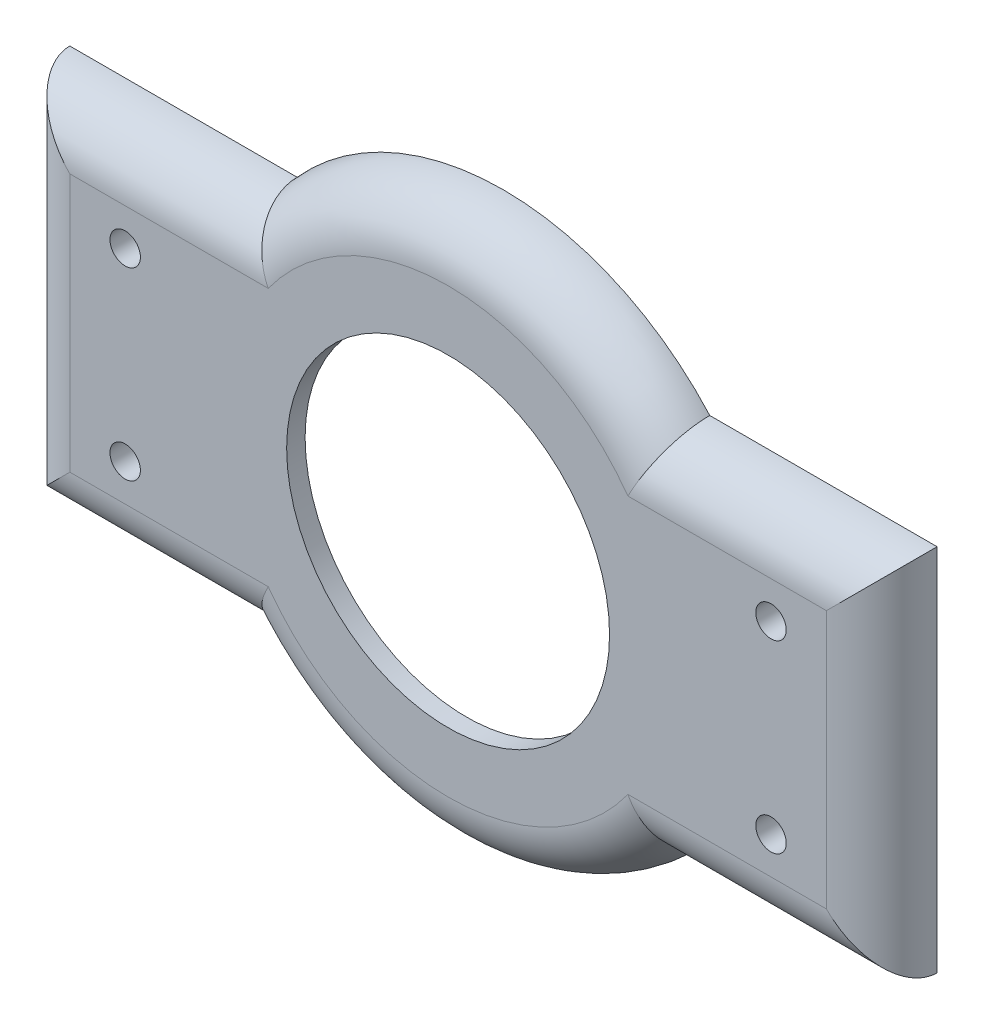
ISO-10303-21;
HEADER;
FILE_DESCRIPTION(('STEP AP214'),'2;1');
FILE_NAME('part.step','',(''),(''),'','','');
FILE_SCHEMA(('AUTOMOTIVE_DESIGN { 1 0 10303 214 1 1 1 1 }'));
ENDSEC;
DATA;
#1=APPLICATION_CONTEXT('core data for automotive mechanical design processes');
#2=APPLICATION_PROTOCOL_DEFINITION('international standard','automotive_design',2000,#1);
#3=PRODUCT_CONTEXT('',#1,'mechanical');
#4=PRODUCT('Part','Part','',(#3));
#5=PRODUCT_RELATED_PRODUCT_CATEGORY('part','',(#4));
#6=PRODUCT_DEFINITION_FORMATION('','',#4);
#7=PRODUCT_DEFINITION_CONTEXT('part definition',#1,'design');
#8=PRODUCT_DEFINITION('design','',#6,#7);
#9=PRODUCT_DEFINITION_SHAPE('','',#8);
#10=(LENGTH_UNIT() NAMED_UNIT(*) SI_UNIT(.MILLI.,.METRE.));
#11=(NAMED_UNIT(*) PLANE_ANGLE_UNIT() SI_UNIT($,.RADIAN.));
#12=(NAMED_UNIT(*) SI_UNIT($,.STERADIAN.) SOLID_ANGLE_UNIT());
#13=UNCERTAINTY_MEASURE_WITH_UNIT(LENGTH_MEASURE(1.E-05),#10,'distance_accuracy_value','');
#14=(GEOMETRIC_REPRESENTATION_CONTEXT(3) GLOBAL_UNCERTAINTY_ASSIGNED_CONTEXT((#13)) GLOBAL_UNIT_ASSIGNED_CONTEXT((#10,
#11,#12)) REPRESENTATION_CONTEXT('',''));
#15=CARTESIAN_POINT('',(0.,0.,0.));
#16=DIRECTION('',(0.,0.,1.));
#17=DIRECTION('',(1.,0.,0.));
#18=AXIS2_PLACEMENT_3D('',#15,#16,#17);
#19=CARTESIAN_POINT('',(0.,0.,2.));
#20=DIRECTION('',(0.,0.,1.));
#21=DIRECTION('',(1.,0.,0.));
#22=AXIS2_PLACEMENT_3D('',#19,#20,#21);
#23=PLANE('',#22);
#24=CARTESIAN_POINT('',(-35.,10.,2.));
#25=DIRECTION('',(0.,0.,1.));
#26=DIRECTION('',(1.,0.,0.));
#27=AXIS2_PLACEMENT_3D('',#24,#25,#26);
#28=CIRCLE('',#27,1.64999999999998);
#29=CARTESIAN_POINT('',(-33.35,10.,2.));
#30=VERTEX_POINT('',#29);
#31=EDGE_CURVE('E225',#30,#30,#28,.T.);
#32=ORIENTED_EDGE('',*,*,#31,.F.);
#33=EDGE_LOOP('',(#32));
#34=FACE_BOUND('',#33,.T.);
#35=CARTESIAN_POINT('',(-35.,-10.,2.));
#36=DIRECTION('',(0.,0.,1.));
#37=DIRECTION('',(1.,0.,0.));
#38=AXIS2_PLACEMENT_3D('',#35,#36,#37);
#39=CIRCLE('',#38,1.64999999999998);
#40=CARTESIAN_POINT('',(-33.35,-10.,2.));
#41=VERTEX_POINT('',#40);
#42=EDGE_CURVE('E227',#41,#41,#39,.T.);
#43=ORIENTED_EDGE('',*,*,#42,.F.);
#44=EDGE_LOOP('',(#43));
#45=FACE_BOUND('',#44,.T.);
#46=CARTESIAN_POINT('',(35.,10.,2.));
#47=DIRECTION('',(0.,0.,1.));
#48=DIRECTION('',(1.,0.,0.));
#49=AXIS2_PLACEMENT_3D('',#46,#47,#48);
#50=CIRCLE('',#49,1.64999999999998);
#51=CARTESIAN_POINT('',(36.65,10.,2.));
#52=VERTEX_POINT('',#51);
#53=EDGE_CURVE('E235',#52,#52,#50,.T.);
#54=ORIENTED_EDGE('',*,*,#53,.F.);
#55=EDGE_LOOP('',(#54));
#56=FACE_BOUND('',#55,.T.);
#57=CARTESIAN_POINT('',(35.,-10.,2.));
#58=DIRECTION('',(0.,0.,1.));
#59=DIRECTION('',(1.,0.,0.));
#60=AXIS2_PLACEMENT_3D('',#57,#58,#59);
#61=CIRCLE('',#60,1.64999999999998);
#62=CARTESIAN_POINT('',(36.65,-10.,2.));
#63=VERTEX_POINT('',#62);
#64=EDGE_CURVE('E241',#63,#63,#61,.T.);
#65=ORIENTED_EDGE('',*,*,#64,.F.);
#66=EDGE_LOOP('',(#65));
#67=FACE_BOUND('',#66,.T.);
#68=DIRECTION('',(-1.,0.,0.));
#69=VECTOR('',#68,1.);
#70=CARTESIAN_POINT('',(0.,-14.,2.));
#71=LINE('',#70,#69);
#72=CARTESIAN_POINT('',(19.4935886896179,-14.,2.));
#73=VERTEX_POINT('',#72);
#74=CARTESIAN_POINT('',(41.,-14.,2.));
#75=VERTEX_POINT('',#74);
#76=EDGE_CURVE('E47',#73,#75,#71,.F.);
#77=ORIENTED_EDGE('',*,*,#76,.T.);
#78=DIRECTION('',(0.,-1.,0.));
#79=VECTOR('',#78,1.);
#80=CARTESIAN_POINT('',(41.,0.,2.));
#81=LINE('',#80,#79);
#82=CARTESIAN_POINT('',(41.,14.,2.));
#83=VERTEX_POINT('',#82);
#84=EDGE_CURVE('E11',#75,#83,#81,.F.);
#85=ORIENTED_EDGE('',*,*,#84,.T.);
#86=DIRECTION('',(1.,0.,0.));
#87=VECTOR('',#86,1.);
#88=CARTESIAN_POINT('',(0.,14.,2.));
#89=LINE('',#88,#87);
#90=CARTESIAN_POINT('',(19.4935886896179,14.,2.));
#91=VERTEX_POINT('',#90);
#92=EDGE_CURVE('E273',#83,#91,#89,.F.);
#93=ORIENTED_EDGE('',*,*,#92,.T.);
#94=CARTESIAN_POINT('',(0.,0.,2.));
#95=DIRECTION('',(0.,0.,1.));
#96=DIRECTION('',(1.,0.,0.));
#97=AXIS2_PLACEMENT_3D('',#94,#95,#96);
#98=CIRCLE('',#97,24.);
#99=CARTESIAN_POINT('',(-19.4935886896179,14.,2.));
#100=VERTEX_POINT('',#99);
#101=EDGE_CURVE('E271',#91,#100,#98,.T.);
#102=ORIENTED_EDGE('',*,*,#101,.T.);
#103=DIRECTION('',(1.,0.,0.));
#104=VECTOR('',#103,1.);
#105=CARTESIAN_POINT('',(0.,14.,2.));
#106=LINE('',#105,#104);
#107=CARTESIAN_POINT('',(-41.,14.,2.));
#108=VERTEX_POINT('',#107);
#109=EDGE_CURVE('E264',#100,#108,#106,.F.);
#110=ORIENTED_EDGE('',*,*,#109,.T.);
#111=DIRECTION('',(0.,1.,0.));
#112=VECTOR('',#111,1.);
#113=CARTESIAN_POINT('',(-41.,0.,2.));
#114=LINE('',#113,#112);
#115=CARTESIAN_POINT('',(-41.,-14.,2.));
#116=VERTEX_POINT('',#115);
#117=EDGE_CURVE('E266',#108,#116,#114,.F.);
#118=ORIENTED_EDGE('',*,*,#117,.T.);
#119=DIRECTION('',(-1.,0.,0.));
#120=VECTOR('',#119,1.);
#121=CARTESIAN_POINT('',(0.,-14.,2.));
#122=LINE('',#121,#120);
#123=CARTESIAN_POINT('',(-19.4935886896179,-14.,2.));
#124=VERTEX_POINT('',#123);
#125=EDGE_CURVE('E129',#116,#124,#122,.F.);
#126=ORIENTED_EDGE('',*,*,#125,.T.);
#127=CARTESIAN_POINT('',(0.,0.,2.));
#128=DIRECTION('',(0.,0.,1.));
#129=DIRECTION('',(1.,0.,0.));
#130=AXIS2_PLACEMENT_3D('',#127,#128,#129);
#131=CIRCLE('',#130,24.);
#132=EDGE_CURVE('E269',#124,#73,#131,.T.);
#133=ORIENTED_EDGE('',*,*,#132,.T.);
#134=EDGE_LOOP('',(#77,#85,#93,#102,#110,#118,#126,#133));
#135=FACE_BOUND('',#134,.T.);
#136=CARTESIAN_POINT('',(0.,0.,2.00000000000003));
#137=DIRECTION('',(0.,0.,-1.));
#138=DIRECTION('',(-1.,0.,0.));
#139=AXIS2_PLACEMENT_3D('',#136,#137,#138);
#140=CIRCLE('',#139,17.5);
#141=CARTESIAN_POINT('',(-17.5,0.,2.00000000000003));
#142=VERTEX_POINT('',#141);
#143=EDGE_CURVE('E126',#142,#142,#140,.T.);
#144=ORIENTED_EDGE('',*,*,#143,.T.);
#145=EDGE_LOOP('',(#144));
#146=FACE_BOUND('',#145,.T.);
#147=ADVANCED_FACE('F38',(#34,#45,#56,#67,#135,#146),#23,.T.);
#148=CARTESIAN_POINT('',(0.,0.,-4.));
#149=DIRECTION('',(0.,0.,-1.));
#150=DIRECTION('',(-1.,0.,0.));
#151=AXIS2_PLACEMENT_3D('',#148,#149,#150);
#152=PLANE('',#151);
#153=CARTESIAN_POINT('',(-35.,10.,-4.));
#154=DIRECTION('',(0.,0.,-1.));
#155=DIRECTION('',(-1.,0.,0.));
#156=AXIS2_PLACEMENT_3D('',#153,#154,#155);
#157=CIRCLE('',#156,1.64999999999999);
#158=CARTESIAN_POINT('',(-36.65,10.,-4.));
#159=VERTEX_POINT('',#158);
#160=EDGE_CURVE('E222',#159,#159,#157,.T.);
#161=ORIENTED_EDGE('',*,*,#160,.F.);
#162=EDGE_LOOP('',(#161));
#163=FACE_BOUND('',#162,.T.);
#164=CARTESIAN_POINT('',(-35.,-10.,-4.));
#165=DIRECTION('',(0.,0.,-1.));
#166=DIRECTION('',(-1.,0.,0.));
#167=AXIS2_PLACEMENT_3D('',#164,#165,#166);
#168=CIRCLE('',#167,1.64999999999999);
#169=CARTESIAN_POINT('',(-36.65,-10.,-4.));
#170=VERTEX_POINT('',#169);
#171=EDGE_CURVE('E232',#170,#170,#168,.T.);
#172=ORIENTED_EDGE('',*,*,#171,.F.);
#173=EDGE_LOOP('',(#172));
#174=FACE_BOUND('',#173,.T.);
#175=CARTESIAN_POINT('',(35.,10.,-4.));
#176=DIRECTION('',(0.,0.,-1.));
#177=DIRECTION('',(-1.,0.,0.));
#178=AXIS2_PLACEMENT_3D('',#175,#176,#177);
#179=CIRCLE('',#178,1.64999999999999);
#180=CARTESIAN_POINT('',(33.35,10.,-4.));
#181=VERTEX_POINT('',#180);
#182=EDGE_CURVE('E238',#181,#181,#179,.T.);
#183=ORIENTED_EDGE('',*,*,#182,.F.);
#184=EDGE_LOOP('',(#183));
#185=FACE_BOUND('',#184,.T.);
#186=CARTESIAN_POINT('',(35.,-10.,-4.));
#187=DIRECTION('',(0.,0.,-1.));
#188=DIRECTION('',(-1.,0.,0.));
#189=AXIS2_PLACEMENT_3D('',#186,#187,#188);
#190=CIRCLE('',#189,1.64999999999999);
#191=CARTESIAN_POINT('',(33.35,-10.,-4.));
#192=VERTEX_POINT('',#191);
#193=EDGE_CURVE('E244',#192,#192,#190,.T.);
#194=ORIENTED_EDGE('',*,*,#193,.F.);
#195=EDGE_LOOP('',(#194));
#196=FACE_BOUND('',#195,.T.);
#197=CARTESIAN_POINT('',(0.,0.,-4.));
#198=DIRECTION('',(0.,0.,-1.));
#199=DIRECTION('',(-1.,0.,0.));
#200=AXIS2_PLACEMENT_3D('',#197,#198,#199);
#201=CIRCLE('',#200,25.);
#202=CARTESIAN_POINT('',(-25.,0.,-4.));
#203=VERTEX_POINT('',#202);
#204=EDGE_CURVE('E257',#203,#203,#201,.T.);
#205=ORIENTED_EDGE('',*,*,#204,.F.);
#206=EDGE_LOOP('',(#205));
#207=FACE_BOUND('',#206,.T.);
#208=CARTESIAN_POINT('',(0.,0.,-4.));
#209=DIRECTION('',(0.,0.,-1.));
#210=DIRECTION('',(-1.,0.,0.));
#211=AXIS2_PLACEMENT_3D('',#208,#209,#210);
#212=CIRCLE('',#211,30.);
#213=CARTESIAN_POINT('',(-22.3606797749979,20.,-4.));
#214=VERTEX_POINT('',#213);
#215=CARTESIAN_POINT('',(22.3606797749979,20.,-4.));
#216=VERTEX_POINT('',#215);
#217=EDGE_CURVE('E262',#214,#216,#212,.T.);
#218=ORIENTED_EDGE('',*,*,#217,.T.);
#219=DIRECTION('',(1.,0.,0.));
#220=VECTOR('',#219,1.);
#221=CARTESIAN_POINT('',(47.,20.,-4.));
#222=LINE('',#221,#220);
#223=CARTESIAN_POINT('',(47.,20.,-4.));
#224=VERTEX_POINT('',#223);
#225=EDGE_CURVE('E125',#216,#224,#222,.T.);
#226=ORIENTED_EDGE('',*,*,#225,.T.);
#227=DIRECTION('',(0.,-1.,0.));
#228=VECTOR('',#227,1.);
#229=CARTESIAN_POINT('',(47.,-20.,-4.));
#230=LINE('',#229,#228);
#231=CARTESIAN_POINT('',(47.,-20.,-4.));
#232=VERTEX_POINT('',#231);
#233=EDGE_CURVE('E116',#224,#232,#230,.T.);
#234=ORIENTED_EDGE('',*,*,#233,.T.);
#235=DIRECTION('',(-1.,0.,0.));
#236=VECTOR('',#235,1.);
#237=CARTESIAN_POINT('',(47.,-20.,-4.));
#238=LINE('',#237,#236);
#239=CARTESIAN_POINT('',(22.3606797749979,-20.,-4.));
#240=VERTEX_POINT('',#239);
#241=EDGE_CURVE('E115',#232,#240,#238,.T.);
#242=ORIENTED_EDGE('',*,*,#241,.T.);
#243=CARTESIAN_POINT('',(-22.3606797749979,-20.,-4.));
#244=VERTEX_POINT('',#243);
#245=EDGE_CURVE('E110',#240,#244,#212,.T.);
#246=ORIENTED_EDGE('',*,*,#245,.T.);
#247=CARTESIAN_POINT('',(-47.,-20.,-4.));
#248=VERTEX_POINT('',#247);
#249=EDGE_CURVE('E104',#244,#248,#238,.T.);
#250=ORIENTED_EDGE('',*,*,#249,.T.);
#251=DIRECTION('',(0.,1.,0.));
#252=VECTOR('',#251,1.);
#253=CARTESIAN_POINT('',(-47.,-20.,-4.));
#254=LINE('',#253,#252);
#255=CARTESIAN_POINT('',(-47.,20.,-4.));
#256=VERTEX_POINT('',#255);
#257=EDGE_CURVE('E107',#248,#256,#254,.T.);
#258=ORIENTED_EDGE('',*,*,#257,.T.);
#259=EDGE_CURVE('E255',#256,#214,#222,.T.);
#260=ORIENTED_EDGE('',*,*,#259,.T.);
#261=EDGE_LOOP('',(#218,#226,#234,#242,#246,#250,#258,#260));
#262=FACE_BOUND('',#261,.T.);
#263=ADVANCED_FACE('F106',(#163,#174,#185,#196,#207,#262),#152,.T.);
#264=CARTESIAN_POINT('',(0.,0.,-4.));
#265=DIRECTION('',(0.,0.,1.));
#266=DIRECTION('',(1.,0.,0.));
#267=AXIS2_PLACEMENT_3D('',#264,#265,#266);
#268=CYLINDRICAL_SURFACE('',#267,25.);
#269=ORIENTED_EDGE('',*,*,#204,.T.);
#270=EDGE_LOOP('',(#269));
#271=FACE_BOUND('',#270,.T.);
#272=CARTESIAN_POINT('',(0.,0.,0.));
#273=DIRECTION('',(0.,0.,-1.));
#274=DIRECTION('',(-1.,0.,0.));
#275=AXIS2_PLACEMENT_3D('',#272,#273,#274);
#276=CIRCLE('',#275,25.);
#277=CARTESIAN_POINT('',(-25.,0.,0.));
#278=VERTEX_POINT('',#277);
#279=EDGE_CURVE('E252',#278,#278,#276,.T.);
#280=ORIENTED_EDGE('',*,*,#279,.F.);
#281=EDGE_LOOP('',(#280));
#282=FACE_BOUND('',#281,.T.);
#283=ADVANCED_FACE('F189',(#271,#282),#268,.F.);
#284=CARTESIAN_POINT('',(0.,0.,0.));
#285=DIRECTION('',(0.,0.,1.));
#286=DIRECTION('',(1.,0.,0.));
#287=AXIS2_PLACEMENT_3D('',#284,#285,#286);
#288=PLANE('',#287);
#289=CARTESIAN_POINT('',(0.,0.,0.));
#290=DIRECTION('',(0.,0.,-1.));
#291=DIRECTION('',(-1.,0.,0.));
#292=AXIS2_PLACEMENT_3D('',#289,#290,#291);
#293=CIRCLE('',#292,17.5);
#294=CARTESIAN_POINT('',(-17.5,0.,0.));
#295=VERTEX_POINT('',#294);
#296=EDGE_CURVE('E131',#295,#295,#293,.T.);
#297=ORIENTED_EDGE('',*,*,#296,.F.);
#298=EDGE_LOOP('',(#297));
#299=FACE_BOUND('',#298,.T.);
#300=ORIENTED_EDGE('',*,*,#279,.T.);
#301=EDGE_LOOP('',(#300));
#302=FACE_BOUND('',#301,.T.);
#303=ADVANCED_FACE('F185',(#299,#302),#288,.F.);
#304=CARTESIAN_POINT('',(0.,0.,2.00000000000003));
#305=DIRECTION('',(0.,0.,-1.));
#306=DIRECTION('',(-1.,0.,0.));
#307=AXIS2_PLACEMENT_3D('',#304,#305,#306);
#308=CYLINDRICAL_SURFACE('',#307,17.5);
#309=ORIENTED_EDGE('',*,*,#143,.F.);
#310=EDGE_LOOP('',(#309));
#311=FACE_BOUND('',#310,.T.);
#312=ORIENTED_EDGE('',*,*,#296,.T.);
#313=EDGE_LOOP('',(#312));
#314=FACE_BOUND('',#313,.T.);
#315=ADVANCED_FACE('F188',(#311,#314),#308,.F.);
#316=CARTESIAN_POINT('',(-41.,-20.,-4.));
#317=DIRECTION('',(0.,1.,0.));
#318=DIRECTION('',(0.,0.,1.));
#319=AXIS2_PLACEMENT_3D('',#316,#317,#318);
#320=CYLINDRICAL_SURFACE('',#319,6.);
#321=CARTESIAN_POINT('',(-41.,-14.,-4.));
#322=DIRECTION('',(-0.707106781186547,0.707106781186547,0.));
#323=DIRECTION('',(0.707106781186547,0.707106781186547,0.));
#324=AXIS2_PLACEMENT_3D('',#321,#322,#323);
#325=ELLIPSE('',#324,8.48528137423857,6.);
#326=EDGE_CURVE('E121',#116,#248,#325,.F.);
#327=ORIENTED_EDGE('',*,*,#326,.F.);
#328=ORIENTED_EDGE('',*,*,#117,.F.);
#329=CARTESIAN_POINT('',(-41.,14.,-4.));
#330=DIRECTION('',(0.707106781186547,0.707106781186547,0.));
#331=DIRECTION('',(0.707106781186547,-0.707106781186547,0.));
#332=AXIS2_PLACEMENT_3D('',#329,#330,#331);
#333=ELLIPSE('',#332,8.48528137423857,6.);
#334=EDGE_CURVE('E42',#256,#108,#333,.T.);
#335=ORIENTED_EDGE('',*,*,#334,.F.);
#336=ORIENTED_EDGE('',*,*,#257,.F.);
#337=EDGE_LOOP('',(#327,#328,#335,#336));
#338=FACE_BOUND('',#337,.T.);
#339=ADVANCED_FACE('F40',(#338),#320,.T.);
#340=CARTESIAN_POINT('',(47.,14.,-4.));
#341=DIRECTION('',(1.,0.,0.));
#342=DIRECTION('',(0.,0.,-1.));
#343=AXIS2_PLACEMENT_3D('',#340,#341,#342);
#344=CYLINDRICAL_SURFACE('',#343,6.);
#345=ORIENTED_EDGE('',*,*,#334,.T.);
#346=ORIENTED_EDGE('',*,*,#109,.F.);
#347=CARTESIAN_POINT('',(-22.3606797749979,20.,-4.));
#348=CARTESIAN_POINT('',(-22.3606885946868,20.0000246248411,-3.8421552052644));
#349=CARTESIAN_POINT('',(-22.3578946208042,19.9937723539707,-3.68431782060247));
#350=CARTESIAN_POINT('',(-22.3467659816735,19.9688946352079,-3.36984998464221));
#351=CARTESIAN_POINT('',(-22.3384324794666,19.9502717845575,-3.21321928697762));
#352=CARTESIAN_POINT('',(-22.3163215306498,19.9009046069552,-2.9027376627166));
#353=CARTESIAN_POINT('',(-22.3025598394186,19.8701953614595,-2.74888002690595));
#354=CARTESIAN_POINT('',(-22.2697136666972,19.7969937760329,-2.44457447554402));
#355=CARTESIAN_POINT('',(-22.2506290856713,19.7545012157596,-2.29412662381104));
#356=CARTESIAN_POINT('',(-22.2073087006702,19.6582045895661,-1.9977544183201));
#357=CARTESIAN_POINT('',(-22.183075687498,19.6044066521063,-1.85182766272716));
#358=CARTESIAN_POINT('',(-22.1296387585979,19.4860098874083,-1.56530631435557));
#359=CARTESIAN_POINT('',(-22.100432998967,19.4214070538535,-1.42471372322721));
#360=CARTESIAN_POINT('',(-22.0372832655125,19.2820428722381,-1.14977619202819));
#361=CARTESIAN_POINT('',(-22.0033394004845,19.2072817574316,-1.01543110859761));
#362=CARTESIAN_POINT('',(-21.9309502480705,19.0482634156329,-0.753694698315457));
#363=CARTESIAN_POINT('',(-21.8925032521829,18.9640025848766,-0.626306037803511));
#364=CARTESIAN_POINT('',(-21.81006943435,18.783868860479,-0.375192277558907));
#365=CARTESIAN_POINT('',(-21.7659437439989,18.6877087181069,-0.251718583062626));
#366=CARTESIAN_POINT('',(-21.6734924399382,18.4869066812776,-0.0135265858213059));
#367=CARTESIAN_POINT('',(-21.6251653105735,18.3822617268776,0.101188529030902));
#368=CARTESIAN_POINT('',(-21.4743637011181,18.0569107969631,0.431340688345207));
#369=CARTESIAN_POINT('',(-21.3660097099654,17.8246587141122,0.632964134834508));
#370=CARTESIAN_POINT('',(-21.1269204948331,17.3165670418239,1.01087006931773));
#371=CARTESIAN_POINT('',(-20.9950785299177,17.0387148777664,1.18371822278674));
#372=CARTESIAN_POINT('',(-20.719257115299,16.4634300807909,1.48053987909019));
#373=CARTESIAN_POINT('',(-20.5752695448377,16.1659843768813,1.60448036194777));
#374=CARTESIAN_POINT('',(-20.2793743453335,15.5615637855901,1.80189453622453));
#375=CARTESIAN_POINT('',(-20.1275296590345,15.2546707934992,1.87571761250212));
#376=CARTESIAN_POINT('',(-19.8180438644189,14.6365503036601,1.97431545107953));
#377=CARTESIAN_POINT('',(-19.660415129243,14.3253328528119,1.99918933026693));
#378=CARTESIAN_POINT('',(-19.498818843525,14.0101964652727,1.99999351599242));
#379=CARTESIAN_POINT('',(-19.4962039457782,14.0050980649796,2.00000001397718));
#380=CARTESIAN_POINT('',(-19.4935886896179,14.,2.));
#381=B_SPLINE_CURVE_WITH_KNOTS('',3,(#347,#348,#349,#350,#351,#352,#353,#354,#355,#356,#357,
#358,#359,#360,#361,#362,#363,#364,#365,#366,#367,#368,#369,#370,#371,#372,#373,#374,#375,#376,
#377,#378,#379,#380),.UNSPECIFIED.,.F.,.F.,(4,2,2,2,2,2,2,2,2,2,2,2,2,2,2,2,4),(0.,
0.473374539403875,0.946649723740478,1.41856121222911,1.89048152583675,2.36214667602337,
2.83398710288178,3.30581669719329,3.77782588851301,4.26508767936846,4.75252598352504,
5.72672161906379,6.78081230257462,7.83561344195162,8.88298355645046,9.92823066732191,
9.94542026148344),.UNSPECIFIED.);
#382=EDGE_CURVE('E130',#214,#100,#381,.T.);
#383=ORIENTED_EDGE('',*,*,#382,.F.);
#384=ORIENTED_EDGE('',*,*,#259,.F.);
#385=EDGE_LOOP('',(#345,#346,#383,#384));
#386=FACE_BOUND('',#385,.T.);
#387=ADVANCED_FACE('F148',(#386),#344,.T.);
#388=CARTESIAN_POINT('',(47.,-14.,-4.));
#389=DIRECTION('',(-1.,0.,0.));
#390=DIRECTION('',(0.,0.,1.));
#391=AXIS2_PLACEMENT_3D('',#388,#389,#390);
#392=CYLINDRICAL_SURFACE('',#391,6.);
#393=ORIENTED_EDGE('',*,*,#326,.T.);
#394=ORIENTED_EDGE('',*,*,#249,.F.);
#395=CARTESIAN_POINT('',(-22.3606797749979,-20.,-4.));
#396=CARTESIAN_POINT('',(-22.3606885946868,-20.0000246248411,-3.8421552052644));
#397=CARTESIAN_POINT('',(-22.3578946208042,-19.9937723539707,-3.68431782060247));
#398=CARTESIAN_POINT('',(-22.3467659816735,-19.9688946352079,-3.36984998464221));
#399=CARTESIAN_POINT('',(-22.3384324794666,-19.9502717845575,-3.21321928697762));
#400=CARTESIAN_POINT('',(-22.3163215306498,-19.9009046069552,-2.9027376627166));
#401=CARTESIAN_POINT('',(-22.3025598394186,-19.8701953614595,-2.74888002690594));
#402=CARTESIAN_POINT('',(-22.2697136666972,-19.7969937760329,-2.44457447554402));
#403=CARTESIAN_POINT('',(-22.2506290856713,-19.7545012157596,-2.29412662381104));
#404=CARTESIAN_POINT('',(-22.2073087006702,-19.6582045895661,-1.9977544183201));
#405=CARTESIAN_POINT('',(-22.183075687498,-19.6044066521063,-1.85182766272716));
#406=CARTESIAN_POINT('',(-22.1296387585979,-19.4860098874083,-1.56530631435557));
#407=CARTESIAN_POINT('',(-22.100432998967,-19.4214070538535,-1.42471372322721));
#408=CARTESIAN_POINT('',(-22.0372832655125,-19.2820428722381,-1.14977619202819));
#409=CARTESIAN_POINT('',(-22.0033394004845,-19.2072817574316,-1.01543110859761));
#410=CARTESIAN_POINT('',(-21.9309502480705,-19.0482634156329,-0.753694698315458));
#411=CARTESIAN_POINT('',(-21.8925032521829,-18.9640025848766,-0.626306037803511));
#412=CARTESIAN_POINT('',(-21.81006943435,-18.783868860479,-0.375192277558906));
#413=CARTESIAN_POINT('',(-21.7659437439989,-18.6877087181069,-0.251718583062626));
#414=CARTESIAN_POINT('',(-21.6734924399382,-18.4869066812776,-0.0135265858213052));
#415=CARTESIAN_POINT('',(-21.6251653105735,-18.3822617268776,0.101188529030902));
#416=CARTESIAN_POINT('',(-21.4743637011181,-18.0569107969631,0.431340688345207));
#417=CARTESIAN_POINT('',(-21.3660097099654,-17.8246587141122,0.632964134834509));
#418=CARTESIAN_POINT('',(-21.1269204948331,-17.3165670418239,1.01087006931773));
#419=CARTESIAN_POINT('',(-20.9950785299177,-17.0387148777664,1.18371822278674));
#420=CARTESIAN_POINT('',(-20.7192571152989,-16.4634300807909,1.48053987909019));
#421=CARTESIAN_POINT('',(-20.5752695448377,-16.1659843768813,1.60448036194777));
#422=CARTESIAN_POINT('',(-20.2793743453335,-15.5615637855901,1.80189453622453));
#423=CARTESIAN_POINT('',(-20.1275296590345,-15.2546707934992,1.87571761250212));
#424=CARTESIAN_POINT('',(-19.8180438644189,-14.6365503036602,1.97431545107953));
#425=CARTESIAN_POINT('',(-19.6604151292429,-14.325332852812,1.99918933026693));
#426=CARTESIAN_POINT('',(-19.498818843525,-14.0101964652727,1.99999351599242));
#427=CARTESIAN_POINT('',(-19.4962039457782,-14.0050980649796,2.00000001397718));
#428=CARTESIAN_POINT('',(-19.4935886896179,-14.,2.));
#429=B_SPLINE_CURVE_WITH_KNOTS('',3,(#395,#396,#397,#398,#399,#400,#401,#402,#403,#404,#405,
#406,#407,#408,#409,#410,#411,#412,#413,#414,#415,#416,#417,#418,#419,#420,#421,#422,#423,#424,
#425,#426,#427,#428),.UNSPECIFIED.,.F.,.F.,(4,2,2,2,2,2,2,2,2,2,2,2,2,2,2,2,4),(0.,
0.473374539403875,0.946649723740479,1.41856121222912,1.89048152583675,2.36214667602337,
2.83398710288178,3.30581669719328,3.77782588851301,4.26508767936846,4.75252598352504,
5.72672161906379,6.78081230257463,7.83561344195162,8.88298355645046,9.92823066732191,
9.94542026148344),.UNSPECIFIED.);
#430=EDGE_CURVE('E133',#124,#244,#429,.F.);
#431=ORIENTED_EDGE('',*,*,#430,.F.);
#432=ORIENTED_EDGE('',*,*,#125,.F.);
#433=EDGE_LOOP('',(#393,#394,#431,#432));
#434=FACE_BOUND('',#433,.T.);
#435=ADVANCED_FACE('F128',(#434),#392,.T.);
#436=CARTESIAN_POINT('',(0.,0.,-4.));
#437=DIRECTION('',(0.,0.,1.));
#438=DIRECTION('',(1.,0.,0.));
#439=AXIS2_PLACEMENT_3D('',#436,#437,#438);
#440=TOROIDAL_SURFACE('',#439,24.,6.);
#441=ORIENTED_EDGE('',*,*,#382,.T.);
#442=ORIENTED_EDGE('',*,*,#101,.F.);
#443=CARTESIAN_POINT('',(22.3606797749979,20.,-4.));
#444=CARTESIAN_POINT('',(22.3606885946868,20.0000246248411,-3.8421552052644));
#445=CARTESIAN_POINT('',(22.3578946208042,19.9937723539707,-3.68431782060247));
#446=CARTESIAN_POINT('',(22.3467659816735,19.9688946352079,-3.36984998464221));
#447=CARTESIAN_POINT('',(22.3384324794666,19.9502717845575,-3.21321928697762));
#448=CARTESIAN_POINT('',(22.3163215306498,19.9009046069552,-2.9027376627166));
#449=CARTESIAN_POINT('',(22.3025598394186,19.8701953614595,-2.74888002690594));
#450=CARTESIAN_POINT('',(22.2697136666972,19.7969937760329,-2.44457447554402));
#451=CARTESIAN_POINT('',(22.2506290856713,19.7545012157596,-2.29412662381104));
#452=CARTESIAN_POINT('',(22.2073087006702,19.6582045895661,-1.9977544183201));
#453=CARTESIAN_POINT('',(22.183075687498,19.6044066521063,-1.85182766272716));
#454=CARTESIAN_POINT('',(22.1296387585979,19.4860098874083,-1.56530631435557));
#455=CARTESIAN_POINT('',(22.100432998967,19.4214070538535,-1.42471372322721));
#456=CARTESIAN_POINT('',(22.0372832655125,19.2820428722381,-1.14977619202819));
#457=CARTESIAN_POINT('',(22.0033394004845,19.2072817574316,-1.01543110859761));
#458=CARTESIAN_POINT('',(21.9309502480705,19.0482634156329,-0.753694698315458));
#459=CARTESIAN_POINT('',(21.8925032521829,18.9640025848766,-0.626306037803511));
#460=CARTESIAN_POINT('',(21.81006943435,18.783868860479,-0.375192277558906));
#461=CARTESIAN_POINT('',(21.7659437439989,18.6877087181069,-0.251718583062626));
#462=CARTESIAN_POINT('',(21.6734924399382,18.4869066812776,-0.0135265858213052));
#463=CARTESIAN_POINT('',(21.6251653105735,18.3822617268776,0.101188529030902));
#464=CARTESIAN_POINT('',(21.4743637011181,18.0569107969631,0.431340688345207));
#465=CARTESIAN_POINT('',(21.3660097099654,17.8246587141122,0.632964134834509));
#466=CARTESIAN_POINT('',(21.1269204948331,17.3165670418239,1.01087006931773));
#467=CARTESIAN_POINT('',(20.9950785299177,17.0387148777664,1.18371822278674));
#468=CARTESIAN_POINT('',(20.7192571152989,16.4634300807909,1.48053987909019));
#469=CARTESIAN_POINT('',(20.5752695448377,16.1659843768813,1.60448036194777));
#470=CARTESIAN_POINT('',(20.2793743453335,15.5615637855901,1.80189453622453));
#471=CARTESIAN_POINT('',(20.1275296590345,15.2546707934992,1.87571761250212));
#472=CARTESIAN_POINT('',(19.8180438644189,14.6365503036602,1.97431545107953));
#473=CARTESIAN_POINT('',(19.6604151292429,14.325332852812,1.99918933026693));
#474=CARTESIAN_POINT('',(19.498818843525,14.0101964652727,1.99999351599242));
#475=CARTESIAN_POINT('',(19.4962039457782,14.0050980649796,2.00000001397718));
#476=CARTESIAN_POINT('',(19.4935886896179,14.,2.));
#477=B_SPLINE_CURVE_WITH_KNOTS('',3,(#443,#444,#445,#446,#447,#448,#449,#450,#451,#452,#453,
#454,#455,#456,#457,#458,#459,#460,#461,#462,#463,#464,#465,#466,#467,#468,#469,#470,#471,#472,
#473,#474,#475,#476),.UNSPECIFIED.,.F.,.F.,(4,2,2,2,2,2,2,2,2,2,2,2,2,2,2,2,4),(0.,
0.473374539403875,0.946649723740479,1.41856121222912,1.89048152583675,2.36214667602337,
2.83398710288178,3.30581669719328,3.77782588851301,4.26508767936846,4.75252598352504,
5.72672161906379,6.78081230257463,7.83561344195162,8.88298355645046,9.92823066732191,
9.94542026148344),.UNSPECIFIED.);
#478=EDGE_CURVE('E161',#216,#91,#477,.T.);
#479=ORIENTED_EDGE('',*,*,#478,.F.);
#480=ORIENTED_EDGE('',*,*,#217,.F.);
#481=EDGE_LOOP('',(#441,#442,#479,#480));
#482=FACE_BOUND('',#481,.T.);
#483=ADVANCED_FACE('F150',(#482),#440,.T.);
#484=CARTESIAN_POINT('',(0.,0.,-4.));
#485=DIRECTION('',(0.,0.,1.));
#486=DIRECTION('',(1.,0.,0.));
#487=AXIS2_PLACEMENT_3D('',#484,#485,#486);
#488=TOROIDAL_SURFACE('',#487,24.,6.);
#489=ORIENTED_EDGE('',*,*,#430,.T.);
#490=ORIENTED_EDGE('',*,*,#245,.F.);
#491=CARTESIAN_POINT('',(22.3606797749979,-20.,-4.));
#492=CARTESIAN_POINT('',(22.3606885946868,-20.0000246248411,-3.8421552052644));
#493=CARTESIAN_POINT('',(22.3578946208042,-19.9937723539707,-3.68431782060247));
#494=CARTESIAN_POINT('',(22.3467659816735,-19.9688946352079,-3.36984998464221));
#495=CARTESIAN_POINT('',(22.3384324794666,-19.9502717845575,-3.21321928697762));
#496=CARTESIAN_POINT('',(22.3163215306498,-19.9009046069552,-2.9027376627166));
#497=CARTESIAN_POINT('',(22.3025598394186,-19.8701953614595,-2.74888002690594));
#498=CARTESIAN_POINT('',(22.2697136666972,-19.7969937760329,-2.44457447554402));
#499=CARTESIAN_POINT('',(22.2506290856713,-19.7545012157596,-2.29412662381104));
#500=CARTESIAN_POINT('',(22.2073087006702,-19.6582045895661,-1.9977544183201));
#501=CARTESIAN_POINT('',(22.183075687498,-19.6044066521063,-1.85182766272716));
#502=CARTESIAN_POINT('',(22.1296387585979,-19.4860098874083,-1.56530631435557));
#503=CARTESIAN_POINT('',(22.100432998967,-19.4214070538535,-1.42471372322721));
#504=CARTESIAN_POINT('',(22.0372832655125,-19.2820428722381,-1.14977619202819));
#505=CARTESIAN_POINT('',(22.0033394004845,-19.2072817574316,-1.01543110859761));
#506=CARTESIAN_POINT('',(21.9309502480705,-19.0482634156329,-0.753694698315458));
#507=CARTESIAN_POINT('',(21.8925032521829,-18.9640025848766,-0.626306037803511));
#508=CARTESIAN_POINT('',(21.81006943435,-18.783868860479,-0.375192277558906));
#509=CARTESIAN_POINT('',(21.7659437439989,-18.6877087181069,-0.251718583062626));
#510=CARTESIAN_POINT('',(21.6734924399382,-18.4869066812776,-0.0135265858213052));
#511=CARTESIAN_POINT('',(21.6251653105735,-18.3822617268776,0.101188529030902));
#512=CARTESIAN_POINT('',(21.4743637011181,-18.0569107969631,0.431340688345207));
#513=CARTESIAN_POINT('',(21.3660097099654,-17.8246587141122,0.632964134834509));
#514=CARTESIAN_POINT('',(21.1269204948331,-17.3165670418239,1.01087006931773));
#515=CARTESIAN_POINT('',(20.9950785299177,-17.0387148777664,1.18371822278674));
#516=CARTESIAN_POINT('',(20.7192571152989,-16.4634300807909,1.48053987909019));
#517=CARTESIAN_POINT('',(20.5752695448377,-16.1659843768813,1.60448036194777));
#518=CARTESIAN_POINT('',(20.2793743453335,-15.5615637855901,1.80189453622453));
#519=CARTESIAN_POINT('',(20.1275296590345,-15.2546707934992,1.87571761250212));
#520=CARTESIAN_POINT('',(19.8180438644189,-14.6365503036602,1.97431545107953));
#521=CARTESIAN_POINT('',(19.6604151292429,-14.325332852812,1.99918933026693));
#522=CARTESIAN_POINT('',(19.498818843525,-14.0101964652727,1.99999351599242));
#523=CARTESIAN_POINT('',(19.4962039457782,-14.0050980649796,2.00000001397718));
#524=CARTESIAN_POINT('',(19.4935886896179,-14.,2.));
#525=B_SPLINE_CURVE_WITH_KNOTS('',3,(#491,#492,#493,#494,#495,#496,#497,#498,#499,#500,#501,
#502,#503,#504,#505,#506,#507,#508,#509,#510,#511,#512,#513,#514,#515,#516,#517,#518,#519,#520,
#521,#522,#523,#524),.UNSPECIFIED.,.F.,.F.,(4,2,2,2,2,2,2,2,2,2,2,2,2,2,2,2,4),(0.,
0.473374539403875,0.946649723740479,1.41856121222912,1.89048152583675,2.36214667602337,
2.83398710288178,3.30581669719328,3.77782588851301,4.26508767936846,4.75252598352504,
5.72672161906379,6.78081230257463,7.83561344195162,8.88298355645046,9.92823066732191,
9.94542026148344),.UNSPECIFIED.);
#526=EDGE_CURVE('E168',#73,#240,#525,.F.);
#527=ORIENTED_EDGE('',*,*,#526,.F.);
#528=ORIENTED_EDGE('',*,*,#132,.F.);
#529=EDGE_LOOP('',(#489,#490,#527,#528));
#530=FACE_BOUND('',#529,.T.);
#531=ADVANCED_FACE('F154',(#530),#488,.T.);
#532=CARTESIAN_POINT('',(47.,14.,-4.));
#533=DIRECTION('',(1.,0.,0.));
#534=DIRECTION('',(0.,0.,-1.));
#535=AXIS2_PLACEMENT_3D('',#532,#533,#534);
#536=CYLINDRICAL_SURFACE('',#535,6.);
#537=ORIENTED_EDGE('',*,*,#478,.T.);
#538=ORIENTED_EDGE('',*,*,#92,.F.);
#539=CARTESIAN_POINT('',(41.,14.,-4.));
#540=DIRECTION('',(0.707106781186547,-0.707106781186547,0.));
#541=DIRECTION('',(0.707106781186547,0.707106781186547,0.));
#542=AXIS2_PLACEMENT_3D('',#539,#540,#541);
#543=ELLIPSE('',#542,8.48528137423857,6.);
#544=EDGE_CURVE('E60',#224,#83,#543,.T.);
#545=ORIENTED_EDGE('',*,*,#544,.F.);
#546=ORIENTED_EDGE('',*,*,#225,.F.);
#547=EDGE_LOOP('',(#537,#538,#545,#546));
#548=FACE_BOUND('',#547,.T.);
#549=ADVANCED_FACE('F158',(#548),#536,.T.);
#550=CARTESIAN_POINT('',(47.,-14.,-4.));
#551=DIRECTION('',(-1.,0.,0.));
#552=DIRECTION('',(0.,0.,1.));
#553=AXIS2_PLACEMENT_3D('',#550,#551,#552);
#554=CYLINDRICAL_SURFACE('',#553,6.);
#555=ORIENTED_EDGE('',*,*,#526,.T.);
#556=ORIENTED_EDGE('',*,*,#241,.F.);
#557=CARTESIAN_POINT('',(41.,-14.,-4.));
#558=DIRECTION('',(-0.707106781186547,-0.707106781186547,0.));
#559=DIRECTION('',(-0.707106781186547,0.707106781186547,0.));
#560=AXIS2_PLACEMENT_3D('',#557,#558,#559);
#561=ELLIPSE('',#560,8.48528137423857,6.);
#562=EDGE_CURVE('E247',#75,#232,#561,.F.);
#563=ORIENTED_EDGE('',*,*,#562,.F.);
#564=ORIENTED_EDGE('',*,*,#76,.F.);
#565=EDGE_LOOP('',(#555,#556,#563,#564));
#566=FACE_BOUND('',#565,.T.);
#567=ADVANCED_FACE('F176',(#566),#554,.T.);
#568=CARTESIAN_POINT('',(41.,-20.,-4.));
#569=DIRECTION('',(0.,-1.,0.));
#570=DIRECTION('',(0.,0.,-1.));
#571=AXIS2_PLACEMENT_3D('',#568,#569,#570);
#572=CYLINDRICAL_SURFACE('',#571,6.);
#573=ORIENTED_EDGE('',*,*,#544,.T.);
#574=ORIENTED_EDGE('',*,*,#84,.F.);
#575=ORIENTED_EDGE('',*,*,#562,.T.);
#576=ORIENTED_EDGE('',*,*,#233,.F.);
#577=EDGE_LOOP('',(#573,#574,#575,#576));
#578=FACE_BOUND('',#577,.T.);
#579=ADVANCED_FACE('F180',(#578),#572,.T.);
#580=CARTESIAN_POINT('',(35.,-10.,2.));
#581=DIRECTION('',(0.,0.,1.));
#582=DIRECTION('',(1.,0.,0.));
#583=AXIS2_PLACEMENT_3D('',#580,#581,#582);
#584=CYLINDRICAL_SURFACE('',#583,1.64999999999999);
#585=ORIENTED_EDGE('',*,*,#193,.T.);
#586=EDGE_LOOP('',(#585));
#587=FACE_BOUND('',#586,.T.);
#588=ORIENTED_EDGE('',*,*,#64,.T.);
#589=EDGE_LOOP('',(#588));
#590=FACE_BOUND('',#589,.T.);
#591=ADVANCED_FACE('F184',(#587,#590),#584,.F.);
#592=CARTESIAN_POINT('',(35.,10.,2.));
#593=DIRECTION('',(0.,0.,1.));
#594=DIRECTION('',(1.,0.,0.));
#595=AXIS2_PLACEMENT_3D('',#592,#593,#594);
#596=CYLINDRICAL_SURFACE('',#595,1.64999999999999);
#597=ORIENTED_EDGE('',*,*,#182,.T.);
#598=EDGE_LOOP('',(#597));
#599=FACE_BOUND('',#598,.T.);
#600=ORIENTED_EDGE('',*,*,#53,.T.);
#601=EDGE_LOOP('',(#600));
#602=FACE_BOUND('',#601,.T.);
#603=ADVANCED_FACE('F205',(#599,#602),#596,.F.);
#604=CARTESIAN_POINT('',(-35.,-10.,2.));
#605=DIRECTION('',(0.,0.,1.));
#606=DIRECTION('',(1.,0.,0.));
#607=AXIS2_PLACEMENT_3D('',#604,#605,#606);
#608=CYLINDRICAL_SURFACE('',#607,1.64999999999999);
#609=ORIENTED_EDGE('',*,*,#171,.T.);
#610=EDGE_LOOP('',(#609));
#611=FACE_BOUND('',#610,.T.);
#612=ORIENTED_EDGE('',*,*,#42,.T.);
#613=EDGE_LOOP('',(#612));
#614=FACE_BOUND('',#613,.T.);
#615=ADVANCED_FACE('F209',(#611,#614),#608,.F.);
#616=CARTESIAN_POINT('',(-35.,10.,2.));
#617=DIRECTION('',(0.,0.,1.));
#618=DIRECTION('',(1.,0.,0.));
#619=AXIS2_PLACEMENT_3D('',#616,#617,#618);
#620=CYLINDRICAL_SURFACE('',#619,1.64999999999999);
#621=ORIENTED_EDGE('',*,*,#160,.T.);
#622=EDGE_LOOP('',(#621));
#623=FACE_BOUND('',#622,.T.);
#624=ORIENTED_EDGE('',*,*,#31,.T.);
#625=EDGE_LOOP('',(#624));
#626=FACE_BOUND('',#625,.T.);
#627=ADVANCED_FACE('F213',(#623,#626),#620,.F.);
#628=CLOSED_SHELL('',(#147,#263,#283,#303,#315,#339,#387,#435,#483,#531,#549,#567,#579,#591,
#603,#615,#627));
#629=MANIFOLD_SOLID_BREP('B2',#628);
#630=ADVANCED_BREP_SHAPE_REPRESENTATION('',(#18,#629),#14);
#631=SHAPE_DEFINITION_REPRESENTATION(#9,#630);
ENDSEC;
END-ISO-10303-21;
